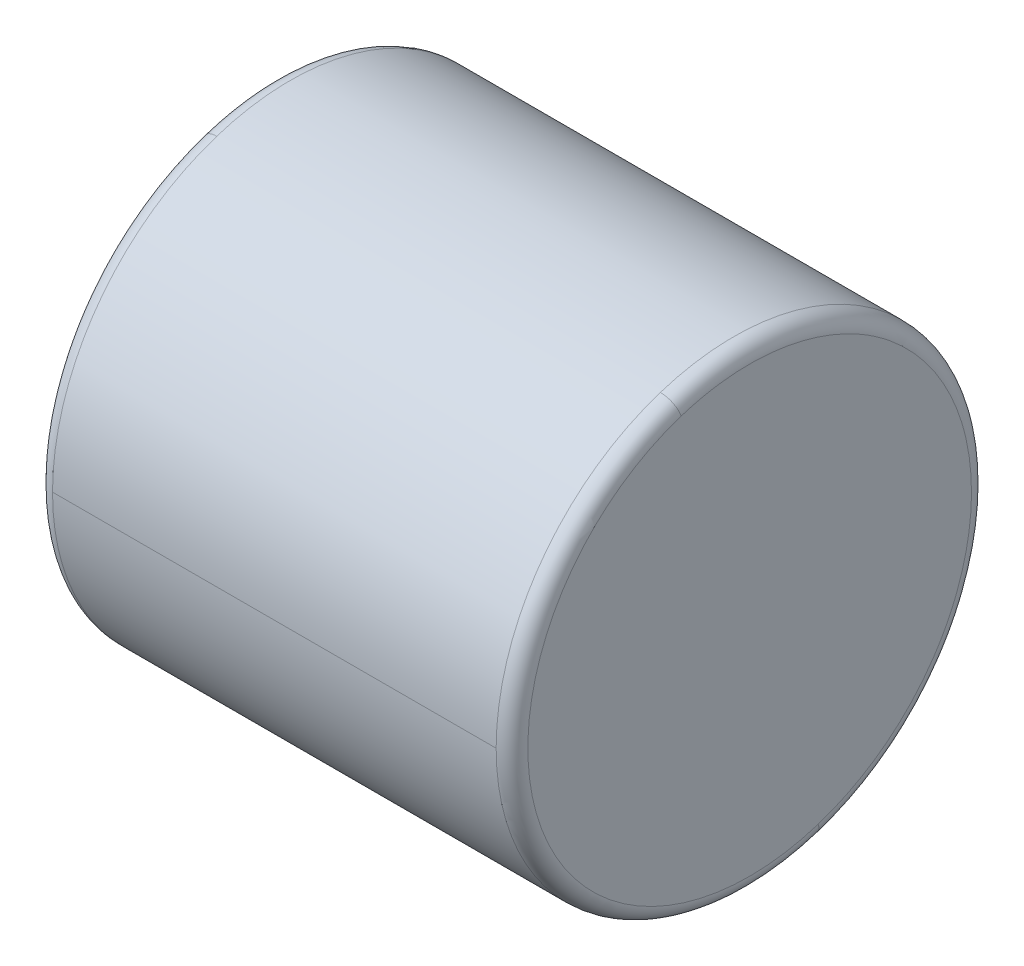
ISO-10303-21;
HEADER;
FILE_DESCRIPTION(('STEP AP214'),'2;1');
FILE_NAME('part.step','',(''),(''),'','','');
FILE_SCHEMA(('AUTOMOTIVE_DESIGN { 1 0 10303 214 1 1 1 1 }'));
ENDSEC;
DATA;
#1=APPLICATION_CONTEXT('core data for automotive mechanical design processes');
#2=APPLICATION_PROTOCOL_DEFINITION('international standard','automotive_design',2000,#1);
#3=PRODUCT_CONTEXT('',#1,'mechanical');
#4=PRODUCT('Part','Part','',(#3));
#5=PRODUCT_RELATED_PRODUCT_CATEGORY('part','',(#4));
#6=PRODUCT_DEFINITION_FORMATION('','',#4);
#7=PRODUCT_DEFINITION_CONTEXT('part definition',#1,'design');
#8=PRODUCT_DEFINITION('design','',#6,#7);
#9=PRODUCT_DEFINITION_SHAPE('','',#8);
#10=(LENGTH_UNIT() NAMED_UNIT(*) SI_UNIT(.MILLI.,.METRE.));
#11=(NAMED_UNIT(*) PLANE_ANGLE_UNIT() SI_UNIT($,.RADIAN.));
#12=(NAMED_UNIT(*) SI_UNIT($,.STERADIAN.) SOLID_ANGLE_UNIT());
#13=UNCERTAINTY_MEASURE_WITH_UNIT(LENGTH_MEASURE(1.E-05),#10,'distance_accuracy_value','');
#14=(GEOMETRIC_REPRESENTATION_CONTEXT(3) GLOBAL_UNCERTAINTY_ASSIGNED_CONTEXT((#13)) GLOBAL_UNIT_ASSIGNED_CONTEXT((#10,
#11,#12)) REPRESENTATION_CONTEXT('',''));
#15=CARTESIAN_POINT('',(0.,0.,0.));
#16=DIRECTION('',(0.,0.,1.));
#17=DIRECTION('',(1.,0.,0.));
#18=AXIS2_PLACEMENT_3D('',#15,#16,#17);
#19=CARTESIAN_POINT('',(3.5,30.25,0.));
#20=DIRECTION('',(1.,0.,0.));
#21=DIRECTION('',(0.,0.,-1.));
#22=AXIS2_PLACEMENT_3D('',#19,#20,#21);
#23=PLANE('',#22);
#24=CARTESIAN_POINT('',(3.5,35.1320901169811,1.58628723779119));
#25=CARTESIAN_POINT('',(3.5,35.1061362210559,1.66617088178049));
#26=CARTESIAN_POINT('',(3.5,35.0782184191581,1.74541625462859));
#27=CARTESIAN_POINT('',(3.5,35.0185295809444,1.90244233184987));
#28=CARTESIAN_POINT('',(3.5,34.9867585446286,1.98022303622305));
#29=CARTESIAN_POINT('',(3.5,34.9194378151061,2.13413165030199));
#30=CARTESIAN_POINT('',(3.5,34.8838881218995,2.21025956000775));
#31=CARTESIAN_POINT('',(3.5,34.8090962465513,2.36067938574912));
#32=CARTESIAN_POINT('',(3.5,34.7698540644097,2.43497130178473));
#33=CARTESIAN_POINT('',(3.5,34.6877716082032,2.58154011091668));
#34=CARTESIAN_POINT('',(3.5,34.6449313341382,2.65381700401302));
#35=CARTESIAN_POINT('',(3.5,34.5557559377961,2.79618166024523));
#36=CARTESIAN_POINT('',(3.5,34.509420815519,2.8662694233811));
#37=CARTESIAN_POINT('',(3.5,34.4133673380085,3.00408696828828));
#38=CARTESIAN_POINT('',(3.5,34.3636489827752,3.0718167500596));
#39=CARTESIAN_POINT('',(3.5,34.2609488179345,3.20475516629089));
#40=CARTESIAN_POINT('',(3.5,34.2079670083271,3.26996380075086));
#41=CARTESIAN_POINT('',(3.5,34.0988675718322,3.39770282877148));
#42=CARTESIAN_POINT('',(3.5,34.0427499449447,3.46023322233212));
#43=CARTESIAN_POINT('',(3.5,33.9275140663626,3.58246512743293));
#44=CARTESIAN_POINT('',(3.5,33.8683958146681,3.64216663897309));
#45=CARTESIAN_POINT('',(3.5,33.7473011074662,3.75859695384257));
#46=CARTESIAN_POINT('',(3.5,33.6853246519589,3.8153257571719));
#47=CARTESIAN_POINT('',(3.5,33.5586628438554,3.92567399096894));
#48=CARTESIAN_POINT('',(3.5,33.4939774912592,3.97929342143667));
#49=CARTESIAN_POINT('',(3.5,33.3620537216543,4.08329373560458));
#50=CARTESIAN_POINT('',(3.5,33.2948153046455,4.13367461930478));
#51=CARTESIAN_POINT('',(3.5,33.1579473894526,4.23107646797634));
#52=CARTESIAN_POINT('',(3.5,33.0883178912683,4.27809743294771));
#53=CARTESIAN_POINT('',(3.5,32.9468355572839,4.36866616653836));
#54=CARTESIAN_POINT('',(3.5,32.8749827214838,4.41221393515763));
#55=CARTESIAN_POINT('',(3.5,32.7292268120428,4.49573136565518));
#56=CARTESIAN_POINT('',(3.5,32.6553237384019,4.53570102753345));
#57=CARTESIAN_POINT('',(3.5,32.5056453922569,4.61196595413259));
#58=CARTESIAN_POINT('',(3.5,32.4298701197527,4.64826121885345));
#59=CARTESIAN_POINT('',(3.5,32.2766299251498,4.71708991266598));
#60=CARTESIAN_POINT('',(3.5,32.199165003051,4.74962334175764));
#61=CARTESIAN_POINT('',(3.5,32.0427321290412,4.81084998843148));
#62=CARTESIAN_POINT('',(3.5,31.9637641771302,4.83954320601366));
#63=CARTESIAN_POINT('',(3.5,31.8045154842089,4.89302030519416));
#64=CARTESIAN_POINT('',(3.5,31.7242347431987,4.91780418679248));
#65=CARTESIAN_POINT('',(3.5,31.5625538754157,4.96340290746367));
#66=CARTESIAN_POINT('',(3.5,31.4811537486431,4.98421774653654));
#67=CARTESIAN_POINT('',(3.5,31.3174302093705,5.02182823738634));
#68=CARTESIAN_POINT('',(3.5,31.2351067968707,5.03862388916328));
#69=CARTESIAN_POINT('',(3.5,31.0697350104551,5.06815554322495));
#70=CARTESIAN_POINT('',(3.5,30.9866866365395,5.08089154550969));
#71=CARTESIAN_POINT('',(3.5,30.8200649980992,5.10227321844193));
#72=CARTESIAN_POINT('',(3.5,30.7364917335747,5.11091888908943));
#73=CARTESIAN_POINT('',(3.5,30.5690216492311,5.12409907056934));
#74=CARTESIAN_POINT('',(3.5,30.4851248294121,5.12863358140174));
#75=CARTESIAN_POINT('',(3.5,30.317209749267,5.13358051921767));
#76=CARTESIAN_POINT('',(3.5,30.2331914889409,5.1339929462012));
#77=CARTESIAN_POINT('',(3.5,30.06523593513,5.13069472274666));
#78=CARTESIAN_POINT('',(3.5,29.9812986416452,5.12698407230859));
#79=CARTESIAN_POINT('',(3.5,29.8137072338087,5.11544863329277));
#80=CARTESIAN_POINT('',(3.5,29.7300531194571,5.10762384471502));
#81=CARTESIAN_POINT('',(3.5,29.5632295999759,5.08787898002089));
#82=CARTESIAN_POINT('',(3.5,29.4800601948463,5.07595890390452));
#83=CARTESIAN_POINT('',(3.5,29.3144064561908,5.04805218064058));
#84=CARTESIAN_POINT('',(3.5,29.2319221226648,5.03206553349302));
#85=CARTESIAN_POINT('',(3.5,29.0678372392009,4.99606418139996));
#86=CARTESIAN_POINT('',(3.5,28.986236689263,4.97604947645446));
#87=CARTESIAN_POINT('',(3.5,28.8241159558471,4.9320402259428));
#88=CARTESIAN_POINT('',(3.5,28.7435957723693,4.90804568037665));
#89=CARTESIAN_POINT('',(3.5,28.5838297520484,4.85613455358565));
#90=CARTESIAN_POINT('',(3.5,28.5045839152053,4.82821797236079));
#91=CARTESIAN_POINT('',(3.5,28.3475574983162,4.76853002774176));
#92=CARTESIAN_POINT('',(3.5,28.2697769182701,4.73675866434757));
#93=CARTESIAN_POINT('',(3.5,28.1158683952049,4.66943769538713));
#94=CARTESIAN_POINT('',(3.5,28.0397404521858,4.63388808982088));
#95=CARTESIAN_POINT('',(3.5,27.8893206020574,4.55909627862988));
#96=CARTESIAN_POINT('',(3.5,27.815028694948,4.51985407300514));
#97=CARTESIAN_POINT('',(3.5,27.6684598923506,4.43777159960774));
#98=CARTESIAN_POINT('',(3.5,27.5961829968624,4.39493133183508));
#99=CARTESIAN_POINT('',(3.5,27.4538183388793,4.30575594009926));
#100=CARTESIAN_POINT('',(3.5,27.3837305763843,4.25942081613611));
#101=CARTESIAN_POINT('',(3.5,27.2459130319463,4.16336733739141));
#102=CARTESIAN_POINT('',(3.5,27.1781832500033,4.11364898260986));
#103=CARTESIAN_POINT('',(3.5,27.0452448336463,4.01094881809986));
#104=CARTESIAN_POINT('',(3.5,26.9800361992323,3.95796700837141));
#105=CARTESIAN_POINT('',(3.5,26.8522971712454,3.8488675717879));
#106=CARTESIAN_POINT('',(3.5,26.7897667776724,3.79274994493283));
#107=CARTESIAN_POINT('',(3.5,26.6675348725626,3.67751406637451));
#108=CARTESIAN_POINT('',(3.5,26.6078333610257,3.61839581467125));
#109=CARTESIAN_POINT('',(3.5,26.4914030461586,3.49730110746303));
#110=CARTESIAN_POINT('',(3.5,26.4346742428284,3.43532465195808));
#111=CARTESIAN_POINT('',(3.5,26.3243260090307,3.30866284385628));
#112=CARTESIAN_POINT('',(3.5,26.2707065785632,3.24397749125944));
#113=CARTESIAN_POINT('',(3.5,26.1667062643955,3.11205372165404));
#114=CARTESIAN_POINT('',(3.5,26.1163253806952,3.04481530464549));
#115=CARTESIAN_POINT('',(3.5,26.0189235320236,2.90794738945263));
#116=CARTESIAN_POINT('',(3.5,25.9719025670523,2.83831789126832));
#117=CARTESIAN_POINT('',(3.5,25.8813338334617,2.69683555728391));
#118=CARTESIAN_POINT('',(3.5,25.8377860648424,2.62498272148381));
#119=CARTESIAN_POINT('',(3.5,25.7542686343448,2.4792268120428));
#120=CARTESIAN_POINT('',(3.5,25.7142989724666,2.4053237384019));
#121=CARTESIAN_POINT('',(3.5,25.6380340458674,2.25564539225686));
#122=CARTESIAN_POINT('',(3.5,25.6017387811466,2.17987011975271));
#123=CARTESIAN_POINT('',(3.5,25.532910087334,2.02662992514976));
#124=CARTESIAN_POINT('',(3.5,25.5003766582423,1.94916500305096));
#125=CARTESIAN_POINT('',(3.5,25.4391500115685,1.79273212904118));
#126=CARTESIAN_POINT('',(3.5,25.4104567939864,1.7137641771302));
#127=CARTESIAN_POINT('',(3.5,25.3569796948058,1.55451548420891));
#128=CARTESIAN_POINT('',(3.5,25.3321958132073,1.47423474319861));
#129=CARTESIAN_POINT('',(3.5,25.2865970925366,1.31255387541582));
#130=CARTESIAN_POINT('',(3.5,25.2657822534643,1.23115374864333));
#131=CARTESIAN_POINT('',(3.5,25.2281717626128,1.06743020937032));
#132=CARTESIAN_POINT('',(3.5,25.2113761108334,0.985106796869799));
#133=CARTESIAN_POINT('',(3.5,25.1818444567783,0.819735010456037));
#134=CARTESIAN_POINT('',(3.5,25.1691084545026,0.736686636542795));
#135=CARTESIAN_POINT('',(3.5,25.1477267815458,0.570064998095913));
#136=CARTESIAN_POINT('',(3.5,25.1390811108648,0.486491733562272));
#137=CARTESIAN_POINT('',(3.5,25.1259009294764,0.319021649243532));
#138=CARTESIAN_POINT('',(3.5,25.121366418769,0.235124829458432));
#139=CARTESIAN_POINT('',(3.5,25.1164194806116,0.067209749220652));
#140=CARTESIAN_POINT('',(3.5,25.1160070531617,-0.0168085112320285));
#141=CARTESIAN_POINT('',(3.5,25.1193052778905,-0.184764064697025));
#142=CARTESIAN_POINT('',(3.5,25.1230159300693,-0.26870135770934));
#143=CARTESIAN_POINT('',(3.5,25.1345513643294,-0.436292766836765));
#144=CARTESIAN_POINT('',(3.5,25.1423761464107,-0.519946882951874));
#145=CARTESIAN_POINT('',(3.5,25.1621210288534,-0.686770397615059));
#146=CARTESIAN_POINT('',(3.5,25.1740411292148,-0.769939796163134));
#147=CARTESIAN_POINT('',(3.5,25.2019477862401,-0.935593552799792));
#148=CARTESIAN_POINT('',(3.5,25.217934342904,-1.01807791088837));
#149=CARTESIAN_POINT('',(3.5,25.253935942203,-1.18216272724582));
#150=CARTESIAN_POINT('',(3.5,25.273950984838,-1.26376318551467));
#151=CARTESIAN_POINT('',(3.5,25.3179593127647,-1.42588416937519));
#152=CARTESIAN_POINT('',(3.5,25.3419525980563,-1.50640469496685));
#153=CARTESIAN_POINT('',(3.5,25.3679098830188,-1.58628723779117));
#154=B_SPLINE_CURVE_WITH_KNOTS('',3,(#24,#25,#26,#27,#28,#29,#30,#31,#32,#33,#34,#35,#36,#37,
#38,#39,#40,#41,#42,#43,#44,#45,#46,#47,#48,#49,#50,#51,#52,#53,#54,#55,#56,#57,#58,#59,#60,#61,
#62,#63,#64,#65,#66,#67,#68,#69,#70,#71,#72,#73,#74,#75,#76,#77,#78,#79,#80,#81,#82,#83,#84,#85,
#86,#87,#88,#89,#90,#91,#92,#93,#94,#95,#96,#97,#98,#99,#100,#101,#102,#103,#104,#105,#106,#107,
#108,#109,#110,#111,#112,#113,#114,#115,#116,#117,#118,#119,#120,#121,#122,#123,#124,#125,#126,
#127,#128,#129,#130,#131,#132,#133,#134,#135,#136,#137,#138,#139,#140,#141,#142,#143,#144,#145,
#146,#147,#148,#149,#150,#151,#152,#153),.UNSPECIFIED.,.F.,.F.,(4,2,2,2,2,2,2,2,2,2,2,2,2,2,2,2,
2,2,2,2,2,2,2,2,2,2,2,2,2,2,2,2,2,2,2,2,2,2,2,2,2,2,2,2,2,2,2,2,2,2,2,2,2,2,2,2,2,2,2,2,2,2,2,2,
4),(0.,0.251956612835199,0.503913225670398,0.755869838505597,1.0078264513408,1.259783064176,
1.51173967701119,1.76369628984639,2.0156529026816,2.2676095155168,2.519566128352,
2.7715227411872,3.02347935402239,3.27543596685759,3.52739257969279,3.77934919252799,
4.03130580536319,4.28326241819839,4.53521903103359,4.78717564386879,5.03913225670399,
5.29108886953919,5.54304548237439,5.79500209520959,6.04695870804478,6.29891532087999,
6.55087193371518,6.80282854655039,7.05478515938558,7.30674177222078,7.55869838505599,
7.81065499789118,8.06261161072638,8.31456822356158,8.56652483639678,8.81848144923198,
9.07043806206718,9.32239467490238,9.57435128773758,9.82630790057278,10.078264513408,
10.3302211262432,10.5821777390784,10.8341343519136,11.0860909647488,11.338047577584,
11.5900041904192,11.8419608032544,12.0939174160896,12.3458740289248,12.59783064176,
12.8497872545952,13.1017438674304,13.3537004802656,13.6056570931008,13.857613705936,
14.1095703187712,14.3615269316064,14.6134835444416,14.8654401572768,15.117396770112,
15.3693533829472,15.6213099957824,15.8732666086176,16.1252232214528),.UNSPECIFIED.);
#155=CARTESIAN_POINT('',(3.5,35.1320901169811,1.58628723779119));
#156=VERTEX_POINT('',#155);
#157=CARTESIAN_POINT('',(3.5,25.3679098830189,-1.58628723779119));
#158=VERTEX_POINT('',#157);
#159=EDGE_CURVE('E11',#156,#158,#154,.T.);
#160=ORIENTED_EDGE('',*,*,#159,.F.);
#161=CARTESIAN_POINT('',(3.5,25.3679098830189,-1.58628723779119));
#162=CARTESIAN_POINT('',(3.5,25.3938637789441,-1.66617088178049));
#163=CARTESIAN_POINT('',(3.5,25.4217815808419,-1.74541625462859));
#164=CARTESIAN_POINT('',(3.5,25.4814704190556,-1.90244233184987));
#165=CARTESIAN_POINT('',(3.5,25.5132414553714,-1.98022303622305));
#166=CARTESIAN_POINT('',(3.5,25.5805621848939,-2.13413165030199));
#167=CARTESIAN_POINT('',(3.5,25.6161118781005,-2.21025956000775));
#168=CARTESIAN_POINT('',(3.5,25.6909037534487,-2.36067938574912));
#169=CARTESIAN_POINT('',(3.5,25.7301459355903,-2.43497130178473));
#170=CARTESIAN_POINT('',(3.5,25.8122283917968,-2.58154011091668));
#171=CARTESIAN_POINT('',(3.5,25.8550686658618,-2.65381700401302));
#172=CARTESIAN_POINT('',(3.5,25.9442440622039,-2.79618166024523));
#173=CARTESIAN_POINT('',(3.5,25.990579184481,-2.86626942338109));
#174=CARTESIAN_POINT('',(3.5,26.0866326619915,-3.00408696828828));
#175=CARTESIAN_POINT('',(3.5,26.1363510172248,-3.0718167500596));
#176=CARTESIAN_POINT('',(3.5,26.2390511820655,-3.20475516629089));
#177=CARTESIAN_POINT('',(3.5,26.2920329916729,-3.26996380075086));
#178=CARTESIAN_POINT('',(3.5,26.4011324281678,-3.39770282877148));
#179=CARTESIAN_POINT('',(3.5,26.4572500550553,-3.46023322233212));
#180=CARTESIAN_POINT('',(3.5,26.5724859336374,-3.58246512743293));
#181=CARTESIAN_POINT('',(3.5,26.6316041853319,-3.64216663897309));
#182=CARTESIAN_POINT('',(3.5,26.7526988925338,-3.75859695384257));
#183=CARTESIAN_POINT('',(3.5,26.8146753480411,-3.81532575717189));
#184=CARTESIAN_POINT('',(3.5,26.9413371561446,-3.92567399096894));
#185=CARTESIAN_POINT('',(3.5,27.0060225087408,-3.97929342143667));
#186=CARTESIAN_POINT('',(3.5,27.1379462783457,-4.08329373560458));
#187=CARTESIAN_POINT('',(3.5,27.2051846953545,-4.13367461930478));
#188=CARTESIAN_POINT('',(3.5,27.3420526105474,-4.23107646797634));
#189=CARTESIAN_POINT('',(3.5,27.4116821087317,-4.27809743294771));
#190=CARTESIAN_POINT('',(3.5,27.5531644427161,-4.36866616653835));
#191=CARTESIAN_POINT('',(3.5,27.6250172785162,-4.41221393515763));
#192=CARTESIAN_POINT('',(3.5,27.7707731879572,-4.49573136565518));
#193=CARTESIAN_POINT('',(3.5,27.8446762615981,-4.53570102753345));
#194=CARTESIAN_POINT('',(3.5,27.9943546077431,-4.61196595413259));
#195=CARTESIAN_POINT('',(3.5,28.0701298802473,-4.64826121885345));
#196=CARTESIAN_POINT('',(3.5,28.2233700748502,-4.71708991266598));
#197=CARTESIAN_POINT('',(3.5,28.300834996949,-4.74962334175764));
#198=CARTESIAN_POINT('',(3.5,28.4572678709588,-4.81084998843148));
#199=CARTESIAN_POINT('',(3.5,28.5362358228698,-4.83954320601366));
#200=CARTESIAN_POINT('',(3.5,28.6954845157911,-4.89302030519416));
#201=CARTESIAN_POINT('',(3.5,28.7757652568013,-4.91780418679248));
#202=CARTESIAN_POINT('',(3.5,28.9374461245843,-4.96340290746367));
#203=CARTESIAN_POINT('',(3.5,29.0188462513569,-4.98421774653654));
#204=CARTESIAN_POINT('',(3.5,29.1825697906294,-5.02182823738634));
#205=CARTESIAN_POINT('',(3.5,29.2648932031293,-5.03862388916327));
#206=CARTESIAN_POINT('',(3.5,29.4302649895449,-5.06815554322495));
#207=CARTESIAN_POINT('',(3.5,29.5133133634605,-5.08089154550969));
#208=CARTESIAN_POINT('',(3.5,29.6799350019008,-5.10227321844193));
#209=CARTESIAN_POINT('',(3.5,29.7635082664253,-5.11091888908943));
#210=CARTESIAN_POINT('',(3.5,29.9309783507689,-5.12409907056934));
#211=CARTESIAN_POINT('',(3.5,30.0148751705879,-5.12863358140174));
#212=CARTESIAN_POINT('',(3.5,30.182790250733,-5.13358051921767));
#213=CARTESIAN_POINT('',(3.5,30.2668085110591,-5.1339929462012));
#214=CARTESIAN_POINT('',(3.5,30.43476406487,-5.13069472274666));
#215=CARTESIAN_POINT('',(3.5,30.5187013583548,-5.12698407230859));
#216=CARTESIAN_POINT('',(3.5,30.6862927661913,-5.11544863329277));
#217=CARTESIAN_POINT('',(3.5,30.7699468805429,-5.10762384471502));
#218=CARTESIAN_POINT('',(3.5,30.9367704000241,-5.08787898002089));
#219=CARTESIAN_POINT('',(3.5,31.0199398051537,-5.07595890390452));
#220=CARTESIAN_POINT('',(3.5,31.1855935438092,-5.04805218064058));
#221=CARTESIAN_POINT('',(3.5,31.2680778773352,-5.03206553349302));
#222=CARTESIAN_POINT('',(3.5,31.432162760799,-4.99606418139996));
#223=CARTESIAN_POINT('',(3.5,31.513763310737,-4.97604947645446));
#224=CARTESIAN_POINT('',(3.5,31.6758840441529,-4.9320402259428));
#225=CARTESIAN_POINT('',(3.5,31.7564042276307,-4.90804568037666));
#226=CARTESIAN_POINT('',(3.5,31.9161702479516,-4.85613455358565));
#227=CARTESIAN_POINT('',(3.5,31.9954160847946,-4.8282179723608));
#228=CARTESIAN_POINT('',(3.5,32.1524425016838,-4.76853002774176));
#229=CARTESIAN_POINT('',(3.5,32.2302230817299,-4.73675866434757));
#230=CARTESIAN_POINT('',(3.5,32.3841316047951,-4.66943769538713));
#231=CARTESIAN_POINT('',(3.5,32.4602595478142,-4.63388808982088));
#232=CARTESIAN_POINT('',(3.5,32.6106793979426,-4.55909627862988));
#233=CARTESIAN_POINT('',(3.5,32.684971305052,-4.51985407300515));
#234=CARTESIAN_POINT('',(3.5,32.8315401076494,-4.43777159960774));
#235=CARTESIAN_POINT('',(3.5,32.9038170031375,-4.39493133183508));
#236=CARTESIAN_POINT('',(3.5,33.0461816611207,-4.30575594009927));
#237=CARTESIAN_POINT('',(3.5,33.1162694236157,-4.25942081613611));
#238=CARTESIAN_POINT('',(3.5,33.2540869680537,-4.16336733739141));
#239=CARTESIAN_POINT('',(3.5,33.3218167499967,-4.11364898260986));
#240=CARTESIAN_POINT('',(3.5,33.4547551663537,-4.01094881809987));
#241=CARTESIAN_POINT('',(3.5,33.5199638007677,-3.95796700837141));
#242=CARTESIAN_POINT('',(3.5,33.6477028287546,-3.8488675717879));
#243=CARTESIAN_POINT('',(3.5,33.7102332223276,-3.79274994493284));
#244=CARTESIAN_POINT('',(3.5,33.8324651274374,-3.67751406637451));
#245=CARTESIAN_POINT('',(3.5,33.8921666389743,-3.61839581467125));
#246=CARTESIAN_POINT('',(3.5,34.0085969538413,-3.49730110746304));
#247=CARTESIAN_POINT('',(3.5,34.0653257571716,-3.43532465195808));
#248=CARTESIAN_POINT('',(3.5,34.1756739909693,-3.30866284385629));
#249=CARTESIAN_POINT('',(3.5,34.2292934214367,-3.24397749125944));
#250=CARTESIAN_POINT('',(3.5,34.3332937356045,-3.11205372165405));
#251=CARTESIAN_POINT('',(3.5,34.3836746193047,-3.04481530464549));
#252=CARTESIAN_POINT('',(3.5,34.4810764679764,-2.90794738945263));
#253=CARTESIAN_POINT('',(3.5,34.5280974329477,-2.83831789126833));
#254=CARTESIAN_POINT('',(3.5,34.6186661665383,-2.69683555728392));
#255=CARTESIAN_POINT('',(3.5,34.6622139351576,-2.62498272148381));
#256=CARTESIAN_POINT('',(3.5,34.7457313656552,-2.47922681204281));
#257=CARTESIAN_POINT('',(3.5,34.7857010275334,-2.40532373840191));
#258=CARTESIAN_POINT('',(3.5,34.8619659541326,-2.25564539225686));
#259=CARTESIAN_POINT('',(3.5,34.8982612188534,-2.17987011975272));
#260=CARTESIAN_POINT('',(3.5,34.967089912666,-2.02662992514977));
#261=CARTESIAN_POINT('',(3.5,34.9996233417576,-1.94916500305097));
#262=CARTESIAN_POINT('',(3.5,35.0608499884315,-1.79273212904118));
#263=CARTESIAN_POINT('',(3.5,35.0895432060136,-1.7137641771302));
#264=CARTESIAN_POINT('',(3.5,35.1430203051942,-1.55451548420892));
#265=CARTESIAN_POINT('',(3.5,35.1678041867927,-1.47423474319862));
#266=CARTESIAN_POINT('',(3.5,35.2134029074634,-1.31255387541582));
#267=CARTESIAN_POINT('',(3.5,35.2342177465357,-1.23115374864334));
#268=CARTESIAN_POINT('',(3.5,35.2718282373872,-1.06743020937033));
#269=CARTESIAN_POINT('',(3.5,35.2886238891666,-0.985106796869807));
#270=CARTESIAN_POINT('',(3.5,35.3181555432217,-0.819735010456044));
#271=CARTESIAN_POINT('',(3.5,35.3308915454974,-0.736686636542802));
#272=CARTESIAN_POINT('',(3.5,35.3522732184542,-0.57006499809592));
#273=CARTESIAN_POINT('',(3.5,35.3609188891352,-0.486491733562281));
#274=CARTESIAN_POINT('',(3.5,35.3740990705236,-0.319021649243542));
#275=CARTESIAN_POINT('',(3.5,35.378633581231,-0.235124829458442));
#276=CARTESIAN_POINT('',(3.5,35.3835805193884,-0.067209749220662));
#277=CARTESIAN_POINT('',(3.5,35.3839929468383,0.0168085112320187));
#278=CARTESIAN_POINT('',(3.5,35.3806947221095,0.184764064697015));
#279=CARTESIAN_POINT('',(3.5,35.3769840699307,0.26870135770933));
#280=CARTESIAN_POINT('',(3.5,35.3654486356706,0.436292766836755));
#281=CARTESIAN_POINT('',(3.5,35.3576238535893,0.519946882951865));
#282=CARTESIAN_POINT('',(3.5,35.3378789711466,0.686770397615051));
#283=CARTESIAN_POINT('',(3.5,35.3259588707852,0.769939796163128));
#284=CARTESIAN_POINT('',(3.5,35.2980522137599,0.935593552799787));
#285=CARTESIAN_POINT('',(3.5,35.282065657096,1.01807791088837));
#286=CARTESIAN_POINT('',(3.5,35.246064057797,1.18216272724581));
#287=CARTESIAN_POINT('',(3.5,35.2260490151619,1.26376318551467));
#288=CARTESIAN_POINT('',(3.5,35.1820406872353,1.42588416937519));
#289=CARTESIAN_POINT('',(3.5,35.1580474019437,1.50640469496684));
#290=CARTESIAN_POINT('',(3.5,35.1320901169812,1.58628723779116));
#291=B_SPLINE_CURVE_WITH_KNOTS('',3,(#161,#162,#163,#164,#165,#166,#167,#168,#169,#170,#171,
#172,#173,#174,#175,#176,#177,#178,#179,#180,#181,#182,#183,#184,#185,#186,#187,#188,#189,#190,
#191,#192,#193,#194,#195,#196,#197,#198,#199,#200,#201,#202,#203,#204,#205,#206,#207,#208,#209,
#210,#211,#212,#213,#214,#215,#216,#217,#218,#219,#220,#221,#222,#223,#224,#225,#226,#227,#228,
#229,#230,#231,#232,#233,#234,#235,#236,#237,#238,#239,#240,#241,#242,#243,#244,#245,#246,#247,
#248,#249,#250,#251,#252,#253,#254,#255,#256,#257,#258,#259,#260,#261,#262,#263,#264,#265,#266,
#267,#268,#269,#270,#271,#272,#273,#274,#275,#276,#277,#278,#279,#280,#281,#282,#283,#284,#285,
#286,#287,#288,#289,#290),.UNSPECIFIED.,.F.,.F.,(4,2,2,2,2,2,2,2,2,2,2,2,2,2,2,2,2,2,2,2,2,2,2,
2,2,2,2,2,2,2,2,2,2,2,2,2,2,2,2,2,2,2,2,2,2,2,2,2,2,2,2,2,2,2,2,2,2,2,2,2,2,2,2,2,4),(0.,
0.2519566128352,0.503913225670399,0.755869838505598,1.0078264513408,1.259783064176,
1.5117396770112,1.76369628984639,2.01565290268159,2.26760951551679,2.51956612835199,
2.77152274118719,3.02347935402239,3.27543596685759,3.52739257969279,3.77934919252799,
4.03130580536319,4.28326241819839,4.53521903103359,4.78717564386879,5.03913225670399,
5.29108886953919,5.54304548237438,5.79500209520959,6.04695870804478,6.29891532087998,
6.55087193371518,6.80282854655038,7.05478515938558,7.30674177222078,7.55869838505598,
7.81065499789118,8.06261161072638,8.31456822356158,8.56652483639677,8.81848144923198,
9.07043806206718,9.32239467490237,9.57435128773758,9.82630790057278,10.078264513408,
10.3302211262432,10.5821777390784,10.8341343519136,11.0860909647488,11.338047577584,
11.5900041904192,11.8419608032544,12.0939174160896,12.3458740289248,12.59783064176,
12.8497872545952,13.1017438674304,13.3537004802656,13.6056570931008,13.857613705936,
14.1095703187712,14.3615269316064,14.6134835444416,14.8654401572768,15.117396770112,
15.3693533829472,15.6213099957824,15.8732666086176,16.1252232214528),.UNSPECIFIED.);
#292=EDGE_CURVE('E26',#158,#156,#291,.T.);
#293=ORIENTED_EDGE('',*,*,#292,.F.);
#294=EDGE_LOOP('',(#160,#293));
#295=FACE_BOUND('',#294,.T.);
#296=ADVANCED_FACE('F17',(#295),#23,.F.);
#297=CARTESIAN_POINT('',(3.86666666666735,30.25,0.));
#298=DIRECTION('',(1.,0.,0.));
#299=DIRECTION('',(0.,-0.309016994374947,0.951056516295154));
#300=AXIS2_PLACEMENT_3D('',#297,#298,#299);
#301=TOROIDAL_SURFACE('',#300,5.13333333333266,0.366666666667348);
#302=CARTESIAN_POINT('',(3.86666666666735,25.3679098830189,-1.58628723779119));
#303=DIRECTION('',(0.,0.309016994374949,-0.951056516295153));
#304=DIRECTION('',(-1.77554940446996E-12,-0.951056516295153,-0.309016994374949));
#305=AXIS2_PLACEMENT_3D('',#302,#303,#304);
#306=CIRCLE('',#305,0.366666666667346);
#307=CARTESIAN_POINT('',(3.8666666666667,25.0191891603766,-1.69959346906221));
#308=VERTEX_POINT('',#307);
#309=EDGE_CURVE('E139',#308,#158,#306,.T.);
#310=ORIENTED_EDGE('',*,*,#309,.T.);
#311=ORIENTED_EDGE('',*,*,#292,.T.);
#312=CARTESIAN_POINT('',(3.86666666666735,35.1320901169811,1.58628723779119));
#313=DIRECTION('',(0.,-0.309016994374946,0.951056516295154));
#314=DIRECTION('',(-1.77554940446994E-12,0.951056516295154,0.309016994374946));
#315=AXIS2_PLACEMENT_3D('',#312,#313,#314);
#316=CIRCLE('',#315,0.366666666667349);
#317=CARTESIAN_POINT('',(3.8666666666667,35.4808108396234,1.69959346906221));
#318=VERTEX_POINT('',#317);
#319=EDGE_CURVE('E135',#318,#156,#316,.T.);
#320=ORIENTED_EDGE('',*,*,#319,.F.);
#321=CARTESIAN_POINT('',(3.8666666666667,30.25,0.));
#322=DIRECTION('',(1.,0.,0.));
#323=DIRECTION('',(0.,0.,-1.));
#324=AXIS2_PLACEMENT_3D('',#321,#322,#323);
#325=CIRCLE('',#324,5.5);
#326=CARTESIAN_POINT('',(3.8666666666667,30.25,-5.5));
#327=VERTEX_POINT('',#326);
#328=EDGE_CURVE('E130',#327,#318,#325,.T.);
#329=ORIENTED_EDGE('',*,*,#328,.F.);
#330=CARTESIAN_POINT('',(3.8666666666667,30.25,0.));
#331=DIRECTION('',(1.,0.,0.));
#332=DIRECTION('',(0.,0.,-1.));
#333=AXIS2_PLACEMENT_3D('',#330,#331,#332);
#334=CIRCLE('',#333,5.5);
#335=EDGE_CURVE('E125',#308,#327,#334,.T.);
#336=ORIENTED_EDGE('',*,*,#335,.F.);
#337=EDGE_LOOP('',(#310,#311,#320,#329,#336));
#338=FACE_BOUND('',#337,.T.);
#339=ADVANCED_FACE('F146',(#338),#301,.T.);
#340=CARTESIAN_POINT('',(14.5,30.25,0.));
#341=DIRECTION('',(1.,0.,0.));
#342=DIRECTION('',(0.,1.,0.));
#343=AXIS2_PLACEMENT_3D('',#340,#341,#342);
#344=CYLINDRICAL_SURFACE('',#343,5.5);
#345=DIRECTION('',(1.,0.,0.));
#346=VECTOR('',#345,1.);
#347=CARTESIAN_POINT('',(3.8666666666667,30.25,5.5));
#348=LINE('',#347,#346);
#349=CARTESIAN_POINT('',(3.8666666666667,30.25,5.5));
#350=VERTEX_POINT('',#349);
#351=CARTESIAN_POINT('',(14.133333333333,30.25,5.5));
#352=VERTEX_POINT('',#351);
#353=EDGE_CURVE('E92',#350,#352,#348,.T.);
#354=ORIENTED_EDGE('',*,*,#353,.F.);
#355=CARTESIAN_POINT('',(3.8666666666667,30.25,0.));
#356=DIRECTION('',(1.,0.,0.));
#357=DIRECTION('',(0.,0.,-1.));
#358=AXIS2_PLACEMENT_3D('',#355,#356,#357);
#359=CIRCLE('',#358,5.5);
#360=EDGE_CURVE('E117',#350,#308,#359,.T.);
#361=ORIENTED_EDGE('',*,*,#360,.T.);
#362=ORIENTED_EDGE('',*,*,#335,.T.);
#363=DIRECTION('',(1.,0.,0.));
#364=VECTOR('',#363,1.);
#365=CARTESIAN_POINT('',(3.8666666666667,30.25,-5.5));
#366=LINE('',#365,#364);
#367=CARTESIAN_POINT('',(14.133333333333,30.25,-5.5));
#368=VERTEX_POINT('',#367);
#369=EDGE_CURVE('E113',#327,#368,#366,.T.);
#370=ORIENTED_EDGE('',*,*,#369,.T.);
#371=CARTESIAN_POINT('',(14.133333333333,30.25,0.));
#372=DIRECTION('',(1.,0.,0.));
#373=DIRECTION('',(0.,0.,-1.));
#374=AXIS2_PLACEMENT_3D('',#371,#372,#373);
#375=CIRCLE('',#374,5.5);
#376=CARTESIAN_POINT('',(14.133333333333,25.0191891603766,-1.69959346906221));
#377=VERTEX_POINT('',#376);
#378=EDGE_CURVE('E84',#377,#368,#375,.T.);
#379=ORIENTED_EDGE('',*,*,#378,.F.);
#380=CARTESIAN_POINT('',(14.133333333333,30.25,0.));
#381=DIRECTION('',(1.,0.,0.));
#382=DIRECTION('',(0.,0.,-1.));
#383=AXIS2_PLACEMENT_3D('',#380,#381,#382);
#384=CIRCLE('',#383,5.5);
#385=EDGE_CURVE('E106',#352,#377,#384,.T.);
#386=ORIENTED_EDGE('',*,*,#385,.F.);
#387=EDGE_LOOP('',(#354,#361,#362,#370,#379,#386));
#388=FACE_BOUND('',#387,.T.);
#389=ADVANCED_FACE('F155',(#388),#344,.T.);
#390=CARTESIAN_POINT('',(14.133333333332,30.25,0.));
#391=DIRECTION('',(1.,0.,0.));
#392=DIRECTION('',(0.,0.309016994374947,-0.951056516295154));
#393=AXIS2_PLACEMENT_3D('',#390,#391,#392);
#394=TOROIDAL_SURFACE('',#393,5.13333333333198,0.366666666668028);
#395=CARTESIAN_POINT('',(14.133333333332,25.3679098830195,-1.58628723779098));
#396=DIRECTION('',(0.,0.309016994374947,-0.951056516295154));
#397=DIRECTION('',(1.,0.,0.));
#398=AXIS2_PLACEMENT_3D('',#395,#396,#397);
#399=CIRCLE('',#398,0.366666666668028);
#400=CARTESIAN_POINT('',(14.5,25.3679098830195,-1.58628723779098));
#401=VERTEX_POINT('',#400);
#402=EDGE_CURVE('E102',#401,#377,#399,.T.);
#403=ORIENTED_EDGE('',*,*,#402,.F.);
#404=CARTESIAN_POINT('',(14.5,30.25,0.));
#405=DIRECTION('',(1.,0.,0.));
#406=DIRECTION('',(0.,0.,-1.));
#407=AXIS2_PLACEMENT_3D('',#404,#405,#406);
#408=CIRCLE('',#407,5.133333333333);
#409=CARTESIAN_POINT('',(14.5,35.1320901169805,1.58628723779098));
#410=VERTEX_POINT('',#409);
#411=EDGE_CURVE('E74',#410,#401,#408,.T.);
#412=ORIENTED_EDGE('',*,*,#411,.F.);
#413=CARTESIAN_POINT('',(14.133333333332,35.1320901169805,1.58628723779098));
#414=DIRECTION('',(0.,-0.309016994374947,0.951056516295154));
#415=DIRECTION('',(1.,0.,0.));
#416=AXIS2_PLACEMENT_3D('',#413,#414,#415);
#417=CIRCLE('',#416,0.366666666668028);
#418=CARTESIAN_POINT('',(14.133333333333,35.4808108396234,1.69959346906221));
#419=VERTEX_POINT('',#418);
#420=EDGE_CURVE('E67',#410,#419,#417,.T.);
#421=ORIENTED_EDGE('',*,*,#420,.T.);
#422=CARTESIAN_POINT('',(14.133333333333,30.25,0.));
#423=DIRECTION('',(1.,0.,0.));
#424=DIRECTION('',(0.,0.,-1.));
#425=AXIS2_PLACEMENT_3D('',#422,#423,#424);
#426=CIRCLE('',#425,5.5);
#427=EDGE_CURVE('E72',#419,#352,#426,.T.);
#428=ORIENTED_EDGE('',*,*,#427,.T.);
#429=ORIENTED_EDGE('',*,*,#385,.T.);
#430=EDGE_LOOP('',(#403,#412,#421,#428,#429));
#431=FACE_BOUND('',#430,.T.);
#432=ADVANCED_FACE('F69',(#431),#394,.T.);
#433=CARTESIAN_POINT('',(14.5,30.25,0.));
#434=DIRECTION('',(1.,0.,0.));
#435=DIRECTION('',(0.,-1.,0.));
#436=AXIS2_PLACEMENT_3D('',#433,#434,#435);
#437=CYLINDRICAL_SURFACE('',#436,5.5);
#438=ORIENTED_EDGE('',*,*,#353,.T.);
#439=ORIENTED_EDGE('',*,*,#427,.F.);
#440=CARTESIAN_POINT('',(14.133333333333,30.25,0.));
#441=DIRECTION('',(1.,0.,0.));
#442=DIRECTION('',(0.,0.,-1.));
#443=AXIS2_PLACEMENT_3D('',#440,#441,#442);
#444=CIRCLE('',#443,5.5);
#445=EDGE_CURVE('E81',#368,#419,#444,.T.);
#446=ORIENTED_EDGE('',*,*,#445,.F.);
#447=ORIENTED_EDGE('',*,*,#369,.F.);
#448=ORIENTED_EDGE('',*,*,#328,.T.);
#449=CARTESIAN_POINT('',(3.8666666666667,30.25,0.));
#450=DIRECTION('',(1.,0.,0.));
#451=DIRECTION('',(0.,0.,-1.));
#452=AXIS2_PLACEMENT_3D('',#449,#450,#451);
#453=CIRCLE('',#452,5.5);
#454=EDGE_CURVE('E87',#318,#350,#453,.T.);
#455=ORIENTED_EDGE('',*,*,#454,.T.);
#456=EDGE_LOOP('',(#438,#439,#446,#447,#448,#455));
#457=FACE_BOUND('',#456,.T.);
#458=ADVANCED_FACE('F90',(#457),#437,.T.);
#459=CARTESIAN_POINT('',(3.86666666666735,30.25,0.));
#460=DIRECTION('',(1.,0.,0.));
#461=DIRECTION('',(0.,0.309016994374947,-0.951056516295154));
#462=AXIS2_PLACEMENT_3D('',#459,#460,#461);
#463=TOROIDAL_SURFACE('',#462,5.13333333333266,0.366666666667348);
#464=ORIENTED_EDGE('',*,*,#309,.F.);
#465=ORIENTED_EDGE('',*,*,#360,.F.);
#466=ORIENTED_EDGE('',*,*,#454,.F.);
#467=ORIENTED_EDGE('',*,*,#319,.T.);
#468=ORIENTED_EDGE('',*,*,#159,.T.);
#469=EDGE_LOOP('',(#464,#465,#466,#467,#468));
#470=FACE_BOUND('',#469,.T.);
#471=ADVANCED_FACE('F164',(#470),#463,.T.);
#472=CARTESIAN_POINT('',(14.133333333332,30.25,0.));
#473=DIRECTION('',(1.,0.,0.));
#474=DIRECTION('',(0.,-0.309016994374947,0.951056516295154));
#475=AXIS2_PLACEMENT_3D('',#472,#473,#474);
#476=TOROIDAL_SURFACE('',#475,5.13333333333198,0.366666666668028);
#477=ORIENTED_EDGE('',*,*,#402,.T.);
#478=ORIENTED_EDGE('',*,*,#378,.T.);
#479=ORIENTED_EDGE('',*,*,#445,.T.);
#480=ORIENTED_EDGE('',*,*,#420,.F.);
#481=CARTESIAN_POINT('',(14.5,25.3679098830185,-1.58628723779129));
#482=CARTESIAN_POINT('',(14.5,25.8667238237302,-3.11935904750787));
#483=CARTESIAN_POINT('',(14.5,26.9648846615729,-4.4609310003261));
#484=CARTESIAN_POINT('',(14.5,28.5729081824736,-5.27817350955591));
#485=CARTESIAN_POINT('',(14.5,32.0315062196139,-5.482912363481));
#486=CARTESIAN_POINT('',(14.5,34.7092283294638,-3.28436223140799));
#487=CARTESIAN_POINT('',(14.5,35.5297835907554,-1.6780266419906));
#488=CARTESIAN_POINT('',(14.5,35.6296581623713,0.0528106121451959));
#489=CARTESIAN_POINT('',(14.5,35.1320901169815,1.58628723779129));
#490=B_SPLINE_CURVE_WITH_KNOTS('',5,(#481,#482,#483,#484,#485,#486,#487,#488,#489),
.UNSPECIFIED.,.F.,.F.,(6,3,6),(0.,1.5707963267949,3.14159265358979),.UNSPECIFIED.);
#491=EDGE_CURVE('E185',#401,#410,#490,.T.);
#492=ORIENTED_EDGE('',*,*,#491,.F.);
#493=EDGE_LOOP('',(#477,#478,#479,#480,#492));
#494=FACE_BOUND('',#493,.T.);
#495=ADVANCED_FACE('F83',(#494),#476,.T.);
#496=CARTESIAN_POINT('',(14.5,35.383333333333,0.));
#497=DIRECTION('',(-1.,0.,0.));
#498=DIRECTION('',(0.,0.,1.));
#499=AXIS2_PLACEMENT_3D('',#496,#497,#498);
#500=PLANE('',#499);
#501=ORIENTED_EDGE('',*,*,#491,.T.);
#502=ORIENTED_EDGE('',*,*,#411,.T.);
#503=EDGE_LOOP('',(#501,#502));
#504=FACE_BOUND('',#503,.T.);
#505=ADVANCED_FACE('F191',(#504),#500,.F.);
#506=CLOSED_SHELL('',(#296,#339,#389,#432,#458,#471,#495,#505));
#507=MANIFOLD_SOLID_BREP('B1',#506);
#508=ADVANCED_BREP_SHAPE_REPRESENTATION('',(#18,#507),#14);
#509=SHAPE_DEFINITION_REPRESENTATION(#9,#508);
ENDSEC;
END-ISO-10303-21;
